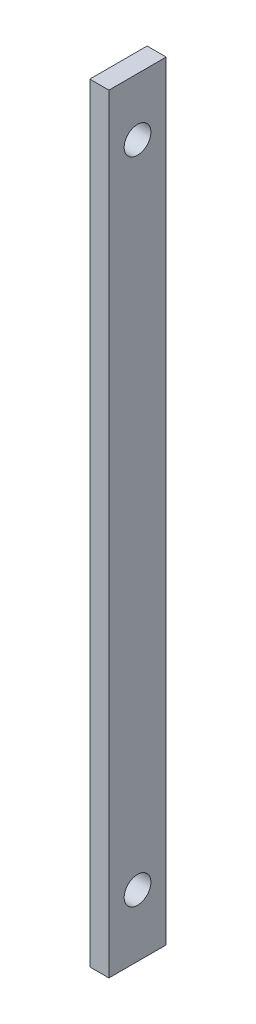
ISO-10303-21;
HEADER;
FILE_DESCRIPTION(('STEP AP214'),'2;1');
FILE_NAME('part.step','',(''),(''),'','','');
FILE_SCHEMA(('AUTOMOTIVE_DESIGN { 1 0 10303 214 1 1 1 1 }'));
ENDSEC;
DATA;
#1=APPLICATION_CONTEXT('core data for automotive mechanical design processes');
#2=APPLICATION_PROTOCOL_DEFINITION('international standard','automotive_design',2000,#1);
#3=PRODUCT_CONTEXT('',#1,'mechanical');
#4=PRODUCT('Part','Part','',(#3));
#5=PRODUCT_RELATED_PRODUCT_CATEGORY('part','',(#4));
#6=PRODUCT_DEFINITION_FORMATION('','',#4);
#7=PRODUCT_DEFINITION_CONTEXT('part definition',#1,'design');
#8=PRODUCT_DEFINITION('design','',#6,#7);
#9=PRODUCT_DEFINITION_SHAPE('','',#8);
#10=(LENGTH_UNIT() NAMED_UNIT(*) SI_UNIT(.MILLI.,.METRE.));
#11=(NAMED_UNIT(*) PLANE_ANGLE_UNIT() SI_UNIT($,.RADIAN.));
#12=(NAMED_UNIT(*) SI_UNIT($,.STERADIAN.) SOLID_ANGLE_UNIT());
#13=UNCERTAINTY_MEASURE_WITH_UNIT(LENGTH_MEASURE(1.E-05),#10,'distance_accuracy_value','');
#14=(GEOMETRIC_REPRESENTATION_CONTEXT(3) GLOBAL_UNCERTAINTY_ASSIGNED_CONTEXT((#13)) GLOBAL_UNIT_ASSIGNED_CONTEXT((#10,
#11,#12)) REPRESENTATION_CONTEXT('',''));
#15=CARTESIAN_POINT('',(0.,0.,0.));
#16=DIRECTION('',(0.,0.,1.));
#17=DIRECTION('',(1.,0.,0.));
#18=AXIS2_PLACEMENT_3D('',#15,#16,#17);
#19=CARTESIAN_POINT('',(5.,47.5349875697449,43.8427363347109));
#20=DIRECTION('',(0.,1.,0.));
#21=DIRECTION('',(0.,0.,1.));
#22=AXIS2_PLACEMENT_3D('',#19,#20,#21);
#23=PLANE('',#22);
#24=DIRECTION('',(0.,0.,-1.));
#25=VECTOR('',#24,1.);
#26=CARTESIAN_POINT('',(0.,47.5349875697449,43.8427363347109));
#27=LINE('',#26,#25);
#28=CARTESIAN_POINT('',(0.,47.5349875697449,43.8427363347109));
#29=VERTEX_POINT('',#28);
#30=CARTESIAN_POINT('',(0.,47.5349875697449,28.8427363347109));
#31=VERTEX_POINT('',#30);
#32=EDGE_CURVE('E105',#29,#31,#27,.T.);
#33=ORIENTED_EDGE('',*,*,#32,.F.);
#34=DIRECTION('',(-1.,0.,0.));
#35=VECTOR('',#34,1.);
#36=CARTESIAN_POINT('',(5.,47.5349875697449,43.8427363347109));
#37=LINE('',#36,#35);
#38=CARTESIAN_POINT('',(5.,47.5349875697449,43.8427363347109));
#39=VERTEX_POINT('',#38);
#40=EDGE_CURVE('E11',#39,#29,#37,.T.);
#41=ORIENTED_EDGE('',*,*,#40,.F.);
#42=DIRECTION('',(0.,0.,-1.));
#43=VECTOR('',#42,1.);
#44=CARTESIAN_POINT('',(5.,47.5349875697449,43.8427363347109));
#45=LINE('',#44,#43);
#46=CARTESIAN_POINT('',(5.,47.5349875697449,28.8427363347109));
#47=VERTEX_POINT('',#46);
#48=EDGE_CURVE('E99',#39,#47,#45,.T.);
#49=ORIENTED_EDGE('',*,*,#48,.T.);
#50=DIRECTION('',(-1.,0.,0.));
#51=VECTOR('',#50,1.);
#52=CARTESIAN_POINT('',(5.,47.5349875697449,28.8427363347109));
#53=LINE('',#52,#51);
#54=EDGE_CURVE('E42',#47,#31,#53,.T.);
#55=ORIENTED_EDGE('',*,*,#54,.T.);
#56=EDGE_LOOP('',(#33,#41,#49,#55));
#57=FACE_BOUND('',#56,.T.);
#58=ADVANCED_FACE('F39',(#57),#23,.T.);
#59=CARTESIAN_POINT('',(5.,47.5349875697449,43.8427363347109));
#60=DIRECTION('',(0.,0.,-1.));
#61=DIRECTION('',(-1.,0.,0.));
#62=AXIS2_PLACEMENT_3D('',#59,#60,#61);
#63=PLANE('',#62);
#64=DIRECTION('',(0.,-1.,0.));
#65=VECTOR('',#64,1.);
#66=CARTESIAN_POINT('',(0.,47.5349875697449,43.8427363347109));
#67=LINE('',#66,#65);
#68=CARTESIAN_POINT('',(0.,-153.710598981327,43.8427363347109));
#69=VERTEX_POINT('',#68);
#70=EDGE_CURVE('E72',#29,#69,#67,.T.);
#71=ORIENTED_EDGE('',*,*,#70,.T.);
#72=DIRECTION('',(-1.,0.,0.));
#73=VECTOR('',#72,1.);
#74=CARTESIAN_POINT('',(5.,-153.710598981327,43.8427363347109));
#75=LINE('',#74,#73);
#76=CARTESIAN_POINT('',(5.,-153.710598981327,43.8427363347109));
#77=VERTEX_POINT('',#76);
#78=EDGE_CURVE('E48',#77,#69,#75,.T.);
#79=ORIENTED_EDGE('',*,*,#78,.F.);
#80=DIRECTION('',(0.,-1.,0.));
#81=VECTOR('',#80,1.);
#82=CARTESIAN_POINT('',(5.,47.5349875697449,43.8427363347109));
#83=LINE('',#82,#81);
#84=EDGE_CURVE('E89',#39,#77,#83,.T.);
#85=ORIENTED_EDGE('',*,*,#84,.F.);
#86=ORIENTED_EDGE('',*,*,#40,.T.);
#87=EDGE_LOOP('',(#71,#79,#85,#86));
#88=FACE_BOUND('',#87,.T.);
#89=ADVANCED_FACE('F116',(#88),#63,.F.);
#90=CARTESIAN_POINT('',(5.,-153.710598981327,43.8427363347109));
#91=DIRECTION('',(0.,1.,0.));
#92=DIRECTION('',(0.,0.,1.));
#93=AXIS2_PLACEMENT_3D('',#90,#91,#92);
#94=PLANE('',#93);
#95=DIRECTION('',(0.,0.,-1.));
#96=VECTOR('',#95,1.);
#97=CARTESIAN_POINT('',(0.,-153.710598981327,43.8427363347109));
#98=LINE('',#97,#96);
#99=CARTESIAN_POINT('',(0.,-153.710598981327,28.8427363347109));
#100=VERTEX_POINT('',#99);
#101=EDGE_CURVE('E96',#69,#100,#98,.T.);
#102=ORIENTED_EDGE('',*,*,#101,.T.);
#103=DIRECTION('',(-1.,0.,0.));
#104=VECTOR('',#103,1.);
#105=CARTESIAN_POINT('',(5.,-153.710598981327,28.8427363347109));
#106=LINE('',#105,#104);
#107=CARTESIAN_POINT('',(5.,-153.710598981327,28.8427363347109));
#108=VERTEX_POINT('',#107);
#109=EDGE_CURVE('E93',#108,#100,#106,.T.);
#110=ORIENTED_EDGE('',*,*,#109,.F.);
#111=DIRECTION('',(0.,0.,-1.));
#112=VECTOR('',#111,1.);
#113=CARTESIAN_POINT('',(5.,-153.710598981327,43.8427363347109));
#114=LINE('',#113,#112);
#115=EDGE_CURVE('E84',#77,#108,#114,.T.);
#116=ORIENTED_EDGE('',*,*,#115,.F.);
#117=ORIENTED_EDGE('',*,*,#78,.T.);
#118=EDGE_LOOP('',(#102,#110,#116,#117));
#119=FACE_BOUND('',#118,.T.);
#120=ADVANCED_FACE('F94',(#119),#94,.F.);
#121=CARTESIAN_POINT('',(5.,47.5349875697449,28.8427363347109));
#122=DIRECTION('',(0.,0.,-1.));
#123=DIRECTION('',(-1.,0.,0.));
#124=AXIS2_PLACEMENT_3D('',#121,#122,#123);
#125=PLANE('',#124);
#126=DIRECTION('',(0.,-1.,0.));
#127=VECTOR('',#126,1.);
#128=CARTESIAN_POINT('',(0.,47.5349875697449,28.8427363347109));
#129=LINE('',#128,#127);
#130=EDGE_CURVE('E108',#31,#100,#129,.T.);
#131=ORIENTED_EDGE('',*,*,#130,.F.);
#132=ORIENTED_EDGE('',*,*,#54,.F.);
#133=DIRECTION('',(0.,-1.,0.));
#134=VECTOR('',#133,1.);
#135=CARTESIAN_POINT('',(5.,47.5349875697449,28.8427363347109));
#136=LINE('',#135,#134);
#137=EDGE_CURVE('E88',#47,#108,#136,.T.);
#138=ORIENTED_EDGE('',*,*,#137,.T.);
#139=ORIENTED_EDGE('',*,*,#109,.T.);
#140=EDGE_LOOP('',(#131,#132,#138,#139));
#141=FACE_BOUND('',#140,.T.);
#142=ADVANCED_FACE('F98',(#141),#125,.T.);
#143=CARTESIAN_POINT('',(5.,0.,0.));
#144=DIRECTION('',(-1.,0.,0.));
#145=DIRECTION('',(0.,0.,1.));
#146=AXIS2_PLACEMENT_3D('',#143,#144,#145);
#147=PLANE('',#146);
#148=CARTESIAN_POINT('',(5.,-137.470598981327,36.3427363347109));
#149=DIRECTION('',(1.,0.,0.));
#150=DIRECTION('',(0.,0.,-1.));
#151=AXIS2_PLACEMENT_3D('',#148,#149,#150);
#152=CIRCLE('',#151,3.49999999999998);
#153=CARTESIAN_POINT('',(5.,-137.470598981327,32.8427363347109));
#154=VERTEX_POINT('',#153);
#155=EDGE_CURVE('E153',#154,#154,#152,.T.);
#156=ORIENTED_EDGE('',*,*,#155,.F.);
#157=EDGE_LOOP('',(#156));
#158=FACE_BOUND('',#157,.T.);
#159=CARTESIAN_POINT('',(5.,32.5349875697449,36.3427363347109));
#160=DIRECTION('',(1.,0.,0.));
#161=DIRECTION('',(0.,0.,-1.));
#162=AXIS2_PLACEMENT_3D('',#159,#160,#161);
#163=CIRCLE('',#162,3.49999999999999);
#164=CARTESIAN_POINT('',(5.,32.5349875697449,32.8427363347109));
#165=VERTEX_POINT('',#164);
#166=EDGE_CURVE('E155',#165,#165,#163,.T.);
#167=ORIENTED_EDGE('',*,*,#166,.F.);
#168=EDGE_LOOP('',(#167));
#169=FACE_BOUND('',#168,.T.);
#170=ORIENTED_EDGE('',*,*,#48,.F.);
#171=ORIENTED_EDGE('',*,*,#84,.T.);
#172=ORIENTED_EDGE('',*,*,#115,.T.);
#173=ORIENTED_EDGE('',*,*,#137,.F.);
#174=EDGE_LOOP('',(#170,#171,#172,#173));
#175=FACE_BOUND('',#174,.T.);
#176=ADVANCED_FACE('F87',(#158,#169,#175),#147,.F.);
#177=CARTESIAN_POINT('',(0.,0.,0.));
#178=DIRECTION('',(-1.,0.,0.));
#179=DIRECTION('',(0.,0.,1.));
#180=AXIS2_PLACEMENT_3D('',#177,#178,#179);
#181=PLANE('',#180);
#182=CARTESIAN_POINT('',(0.,-137.470598981327,36.3427363347109));
#183=DIRECTION('',(1.,0.,0.));
#184=DIRECTION('',(0.,0.,-1.));
#185=AXIS2_PLACEMENT_3D('',#182,#183,#184);
#186=CIRCLE('',#185,3.5);
#187=CARTESIAN_POINT('',(0.,-137.470598981327,32.8427363347109));
#188=VERTEX_POINT('',#187);
#189=EDGE_CURVE('E151',#188,#188,#186,.T.);
#190=ORIENTED_EDGE('',*,*,#189,.T.);
#191=EDGE_LOOP('',(#190));
#192=FACE_BOUND('',#191,.T.);
#193=CARTESIAN_POINT('',(0.,32.5349875697449,36.3427363347109));
#194=DIRECTION('',(1.,0.,0.));
#195=DIRECTION('',(0.,0.,-1.));
#196=AXIS2_PLACEMENT_3D('',#193,#194,#195);
#197=CIRCLE('',#196,3.5);
#198=CARTESIAN_POINT('',(0.,32.5349875697449,32.8427363347109));
#199=VERTEX_POINT('',#198);
#200=EDGE_CURVE('E109',#199,#199,#197,.T.);
#201=ORIENTED_EDGE('',*,*,#200,.T.);
#202=EDGE_LOOP('',(#201));
#203=FACE_BOUND('',#202,.T.);
#204=ORIENTED_EDGE('',*,*,#32,.T.);
#205=ORIENTED_EDGE('',*,*,#130,.T.);
#206=ORIENTED_EDGE('',*,*,#101,.F.);
#207=ORIENTED_EDGE('',*,*,#70,.F.);
#208=EDGE_LOOP('',(#204,#205,#206,#207));
#209=FACE_BOUND('',#208,.T.);
#210=ADVANCED_FACE('F114',(#192,#203,#209),#181,.T.);
#211=CARTESIAN_POINT('',(5.,32.5349875697449,36.3427363347109));
#212=DIRECTION('',(1.,0.,0.));
#213=DIRECTION('',(0.,0.,-1.));
#214=AXIS2_PLACEMENT_3D('',#211,#212,#213);
#215=CYLINDRICAL_SURFACE('',#214,3.49999999999999);
#216=ORIENTED_EDGE('',*,*,#200,.F.);
#217=EDGE_LOOP('',(#216));
#218=FACE_BOUND('',#217,.T.);
#219=ORIENTED_EDGE('',*,*,#166,.T.);
#220=EDGE_LOOP('',(#219));
#221=FACE_BOUND('',#220,.T.);
#222=ADVANCED_FACE('F135',(#218,#221),#215,.F.);
#223=CARTESIAN_POINT('',(5.,-137.470598981327,36.3427363347109));
#224=DIRECTION('',(1.,0.,0.));
#225=DIRECTION('',(0.,0.,-1.));
#226=AXIS2_PLACEMENT_3D('',#223,#224,#225);
#227=CYLINDRICAL_SURFACE('',#226,3.49999999999999);
#228=ORIENTED_EDGE('',*,*,#189,.F.);
#229=EDGE_LOOP('',(#228));
#230=FACE_BOUND('',#229,.T.);
#231=ORIENTED_EDGE('',*,*,#155,.T.);
#232=EDGE_LOOP('',(#231));
#233=FACE_BOUND('',#232,.T.);
#234=ADVANCED_FACE('F142',(#230,#233),#227,.F.);
#235=CLOSED_SHELL('',(#58,#89,#120,#142,#176,#210,#222,#234));
#236=MANIFOLD_SOLID_BREP('B2',#235);
#237=ADVANCED_BREP_SHAPE_REPRESENTATION('',(#18,#236),#14);
#238=SHAPE_DEFINITION_REPRESENTATION(#9,#237);
ENDSEC;
END-ISO-10303-21;
